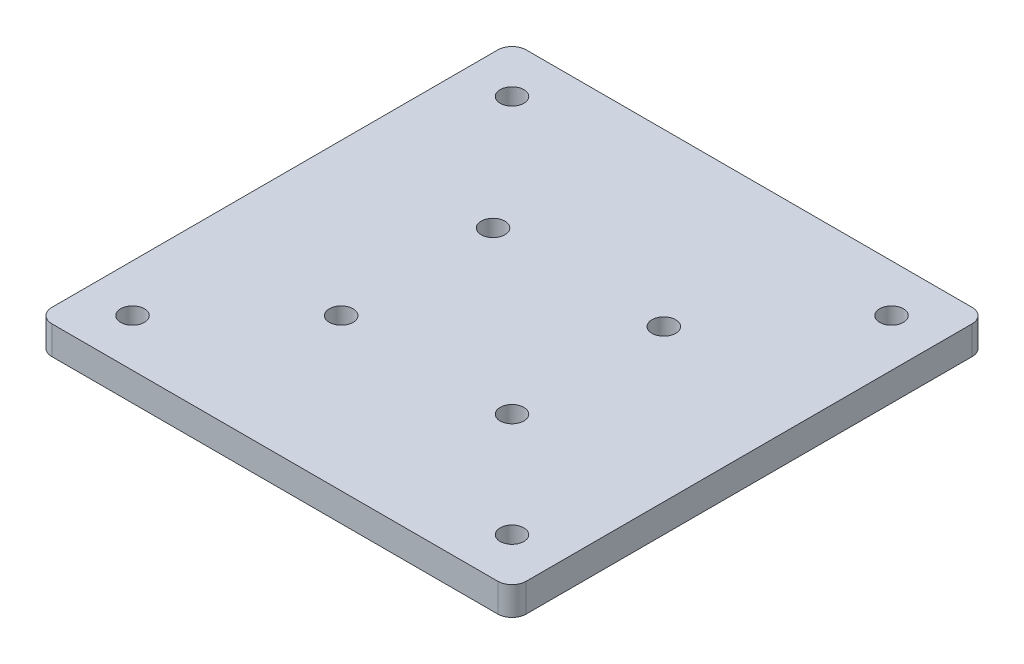
ISO-10303-21;
HEADER;
FILE_DESCRIPTION(('STEP AP214'),'2;1');
FILE_NAME('part.step','',(''),(''),'','','');
FILE_SCHEMA(('AUTOMOTIVE_DESIGN { 1 0 10303 214 1 1 1 1 }'));
ENDSEC;
DATA;
#1=APPLICATION_CONTEXT('core data for automotive mechanical design processes');
#2=APPLICATION_PROTOCOL_DEFINITION('international standard','automotive_design',2000,#1);
#3=PRODUCT_CONTEXT('',#1,'mechanical');
#4=PRODUCT('Part','Part','',(#3));
#5=PRODUCT_RELATED_PRODUCT_CATEGORY('part','',(#4));
#6=PRODUCT_DEFINITION_FORMATION('','',#4);
#7=PRODUCT_DEFINITION_CONTEXT('part definition',#1,'design');
#8=PRODUCT_DEFINITION('design','',#6,#7);
#9=PRODUCT_DEFINITION_SHAPE('','',#8);
#10=(LENGTH_UNIT() NAMED_UNIT(*) SI_UNIT(.MILLI.,.METRE.));
#11=(NAMED_UNIT(*) PLANE_ANGLE_UNIT() SI_UNIT($,.RADIAN.));
#12=(NAMED_UNIT(*) SI_UNIT($,.STERADIAN.) SOLID_ANGLE_UNIT());
#13=UNCERTAINTY_MEASURE_WITH_UNIT(LENGTH_MEASURE(1.E-05),#10,'distance_accuracy_value','');
#14=(GEOMETRIC_REPRESENTATION_CONTEXT(3) GLOBAL_UNCERTAINTY_ASSIGNED_CONTEXT((#13)) GLOBAL_UNIT_ASSIGNED_CONTEXT((#10,
#11,#12)) REPRESENTATION_CONTEXT('',''));
#15=CARTESIAN_POINT('',(0.,0.,0.));
#16=DIRECTION('',(0.,0.,1.));
#17=DIRECTION('',(1.,0.,0.));
#18=AXIS2_PLACEMENT_3D('',#15,#16,#17);
#19=CARTESIAN_POINT('',(0.,6.,0.));
#20=DIRECTION('',(0.,1.,0.));
#21=DIRECTION('',(0.,0.,1.));
#22=AXIS2_PLACEMENT_3D('',#19,#20,#21);
#23=PLANE('',#22);
#24=CARTESIAN_POINT('',(22.,6.,-54.));
#25=DIRECTION('',(0.,1.,0.));
#26=DIRECTION('',(0.,0.,1.));
#27=AXIS2_PLACEMENT_3D('',#24,#25,#26);
#28=CIRCLE('',#27,2.5);
#29=CARTESIAN_POINT('',(22.,6.,-51.5));
#30=VERTEX_POINT('',#29);
#31=EDGE_CURVE('E218',#30,#30,#28,.T.);
#32=ORIENTED_EDGE('',*,*,#31,.F.);
#33=EDGE_LOOP('',(#32));
#34=FACE_BOUND('',#33,.T.);
#35=CARTESIAN_POINT('',(22.,6.,-22.));
#36=DIRECTION('',(0.,1.,0.));
#37=DIRECTION('',(0.,0.,1.));
#38=AXIS2_PLACEMENT_3D('',#35,#36,#37);
#39=CIRCLE('',#38,2.5);
#40=CARTESIAN_POINT('',(22.,6.,-19.5));
#41=VERTEX_POINT('',#40);
#42=EDGE_CURVE('E206',#41,#41,#39,.T.);
#43=ORIENTED_EDGE('',*,*,#42,.F.);
#44=EDGE_LOOP('',(#43));
#45=FACE_BOUND('',#44,.T.);
#46=CARTESIAN_POINT('',(0.,6.,-80.));
#47=DIRECTION('',(0.,1.,0.));
#48=DIRECTION('',(0.,0.,1.));
#49=AXIS2_PLACEMENT_3D('',#46,#47,#48);
#50=CIRCLE('',#49,2.5);
#51=CARTESIAN_POINT('',(0.,6.,-77.5));
#52=VERTEX_POINT('',#51);
#53=EDGE_CURVE('E194',#52,#52,#50,.T.);
#54=ORIENTED_EDGE('',*,*,#53,.F.);
#55=EDGE_LOOP('',(#54));
#56=FACE_BOUND('',#55,.T.);
#57=CARTESIAN_POINT('',(0.,6.,0.));
#58=DIRECTION('',(0.,1.,0.));
#59=DIRECTION('',(0.,0.,1.));
#60=AXIS2_PLACEMENT_3D('',#57,#58,#59);
#61=CIRCLE('',#60,2.5);
#62=CARTESIAN_POINT('',(0.,6.,2.5));
#63=VERTEX_POINT('',#62);
#64=EDGE_CURVE('E132',#63,#63,#61,.T.);
#65=ORIENTED_EDGE('',*,*,#64,.F.);
#66=EDGE_LOOP('',(#65));
#67=FACE_BOUND('',#66,.T.);
#68=DIRECTION('',(-1.,0.,0.));
#69=VECTOR('',#68,1.);
#70=CARTESIAN_POINT('',(-10.,6.,-90.));
#71=LINE('',#70,#69);
#72=CARTESIAN_POINT('',(87.,6.,-90.));
#73=VERTEX_POINT('',#72);
#74=CARTESIAN_POINT('',(-7.00000000000001,6.,-90.));
#75=VERTEX_POINT('',#74);
#76=EDGE_CURVE('E138',#73,#75,#71,.T.);
#77=ORIENTED_EDGE('',*,*,#76,.T.);
#78=CARTESIAN_POINT('',(-7.00000000000001,6.,-87.));
#79=DIRECTION('',(0.,1.,0.));
#80=DIRECTION('',(0.,0.,1.));
#81=AXIS2_PLACEMENT_3D('',#78,#79,#80);
#82=CIRCLE('',#81,3.);
#83=CARTESIAN_POINT('',(-10.,6.,-87.));
#84=VERTEX_POINT('',#83);
#85=EDGE_CURVE('E42',#75,#84,#82,.T.);
#86=ORIENTED_EDGE('',*,*,#85,.T.);
#87=DIRECTION('',(0.,0.,1.));
#88=VECTOR('',#87,1.);
#89=CARTESIAN_POINT('',(-10.,6.,-90.));
#90=LINE('',#89,#88);
#91=CARTESIAN_POINT('',(-10.,6.,7.00000000000001));
#92=VERTEX_POINT('',#91);
#93=EDGE_CURVE('E137',#84,#92,#90,.T.);
#94=ORIENTED_EDGE('',*,*,#93,.T.);
#95=CARTESIAN_POINT('',(-7.,6.,7.));
#96=DIRECTION('',(0.,1.,0.));
#97=DIRECTION('',(0.,0.,1.));
#98=AXIS2_PLACEMENT_3D('',#95,#96,#97);
#99=CIRCLE('',#98,3.);
#100=CARTESIAN_POINT('',(-7.,6.,10.));
#101=VERTEX_POINT('',#100);
#102=EDGE_CURVE('E144',#92,#101,#99,.T.);
#103=ORIENTED_EDGE('',*,*,#102,.T.);
#104=DIRECTION('',(1.,0.,0.));
#105=VECTOR('',#104,1.);
#106=CARTESIAN_POINT('',(-10.,6.,10.));
#107=LINE('',#106,#105);
#108=CARTESIAN_POINT('',(87.,6.,10.));
#109=VERTEX_POINT('',#108);
#110=EDGE_CURVE('E121',#101,#109,#107,.T.);
#111=ORIENTED_EDGE('',*,*,#110,.T.);
#112=CARTESIAN_POINT('',(87.,6.,7.00000000000001));
#113=DIRECTION('',(0.,1.,0.));
#114=DIRECTION('',(0.,0.,1.));
#115=AXIS2_PLACEMENT_3D('',#112,#113,#114);
#116=CIRCLE('',#115,3.);
#117=CARTESIAN_POINT('',(90.,6.,7.00000000000001));
#118=VERTEX_POINT('',#117);
#119=EDGE_CURVE('E142',#109,#118,#116,.T.);
#120=ORIENTED_EDGE('',*,*,#119,.T.);
#121=DIRECTION('',(0.,0.,-1.));
#122=VECTOR('',#121,1.);
#123=CARTESIAN_POINT('',(90.,6.,-90.));
#124=LINE('',#123,#122);
#125=CARTESIAN_POINT('',(90.,6.,-87.));
#126=VERTEX_POINT('',#125);
#127=EDGE_CURVE('E178',#118,#126,#124,.T.);
#128=ORIENTED_EDGE('',*,*,#127,.T.);
#129=CARTESIAN_POINT('',(87.,6.,-87.));
#130=DIRECTION('',(0.,1.,0.));
#131=DIRECTION('',(0.,0.,1.));
#132=AXIS2_PLACEMENT_3D('',#129,#130,#131);
#133=CIRCLE('',#132,3.);
#134=EDGE_CURVE('E160',#126,#73,#133,.T.);
#135=ORIENTED_EDGE('',*,*,#134,.T.);
#136=EDGE_LOOP('',(#77,#86,#94,#103,#111,#120,#128,#135));
#137=FACE_BOUND('',#136,.T.);
#138=CARTESIAN_POINT('',(80.,6.,0.));
#139=DIRECTION('',(0.,1.,0.));
#140=DIRECTION('',(0.,0.,1.));
#141=AXIS2_PLACEMENT_3D('',#138,#139,#140);
#142=CIRCLE('',#141,2.5);
#143=CARTESIAN_POINT('',(80.,6.,2.5));
#144=VERTEX_POINT('',#143);
#145=EDGE_CURVE('E188',#144,#144,#142,.T.);
#146=ORIENTED_EDGE('',*,*,#145,.F.);
#147=EDGE_LOOP('',(#146));
#148=FACE_BOUND('',#147,.T.);
#149=CARTESIAN_POINT('',(80.,6.,-80.));
#150=DIRECTION('',(0.,1.,0.));
#151=DIRECTION('',(0.,0.,1.));
#152=AXIS2_PLACEMENT_3D('',#149,#150,#151);
#153=CIRCLE('',#152,2.5);
#154=CARTESIAN_POINT('',(80.,6.,-77.5));
#155=VERTEX_POINT('',#154);
#156=EDGE_CURVE('E200',#155,#155,#153,.T.);
#157=ORIENTED_EDGE('',*,*,#156,.F.);
#158=EDGE_LOOP('',(#157));
#159=FACE_BOUND('',#158,.T.);
#160=CARTESIAN_POINT('',(58.,6.,-22.));
#161=DIRECTION('',(0.,1.,0.));
#162=DIRECTION('',(0.,0.,1.));
#163=AXIS2_PLACEMENT_3D('',#160,#161,#162);
#164=CIRCLE('',#163,2.5);
#165=CARTESIAN_POINT('',(58.,6.,-19.5));
#166=VERTEX_POINT('',#165);
#167=EDGE_CURVE('E212',#166,#166,#164,.T.);
#168=ORIENTED_EDGE('',*,*,#167,.F.);
#169=EDGE_LOOP('',(#168));
#170=FACE_BOUND('',#169,.T.);
#171=CARTESIAN_POINT('',(58.,6.,-54.));
#172=DIRECTION('',(0.,1.,0.));
#173=DIRECTION('',(0.,0.,1.));
#174=AXIS2_PLACEMENT_3D('',#171,#172,#173);
#175=CIRCLE('',#174,2.50000000000001);
#176=CARTESIAN_POINT('',(58.,6.,-51.5));
#177=VERTEX_POINT('',#176);
#178=EDGE_CURVE('E224',#177,#177,#175,.T.);
#179=ORIENTED_EDGE('',*,*,#178,.F.);
#180=EDGE_LOOP('',(#179));
#181=FACE_BOUND('',#180,.T.);
#182=ADVANCED_FACE('F34',(#34,#45,#56,#67,#137,#148,#159,#170,#181),#23,.T.);
#183=CARTESIAN_POINT('',(0.,0.,0.));
#184=DIRECTION('',(0.,1.,0.));
#185=DIRECTION('',(0.,0.,1.));
#186=AXIS2_PLACEMENT_3D('',#183,#184,#185);
#187=PLANE('',#186);
#188=CARTESIAN_POINT('',(22.,0.,-54.));
#189=DIRECTION('',(0.,1.,0.));
#190=DIRECTION('',(0.,0.,1.));
#191=AXIS2_PLACEMENT_3D('',#188,#189,#190);
#192=CIRCLE('',#191,2.5);
#193=CARTESIAN_POINT('',(22.,0.,-51.5));
#194=VERTEX_POINT('',#193);
#195=EDGE_CURVE('E221',#194,#194,#192,.T.);
#196=ORIENTED_EDGE('',*,*,#195,.T.);
#197=EDGE_LOOP('',(#196));
#198=FACE_BOUND('',#197,.T.);
#199=CARTESIAN_POINT('',(22.,0.,-22.));
#200=DIRECTION('',(0.,1.,0.));
#201=DIRECTION('',(0.,0.,1.));
#202=AXIS2_PLACEMENT_3D('',#199,#200,#201);
#203=CIRCLE('',#202,2.5);
#204=CARTESIAN_POINT('',(22.,0.,-19.5));
#205=VERTEX_POINT('',#204);
#206=EDGE_CURVE('E209',#205,#205,#203,.T.);
#207=ORIENTED_EDGE('',*,*,#206,.T.);
#208=EDGE_LOOP('',(#207));
#209=FACE_BOUND('',#208,.T.);
#210=CARTESIAN_POINT('',(0.,0.,-80.));
#211=DIRECTION('',(0.,1.,0.));
#212=DIRECTION('',(0.,0.,1.));
#213=AXIS2_PLACEMENT_3D('',#210,#211,#212);
#214=CIRCLE('',#213,2.5);
#215=CARTESIAN_POINT('',(0.,0.,-77.5));
#216=VERTEX_POINT('',#215);
#217=EDGE_CURVE('E197',#216,#216,#214,.T.);
#218=ORIENTED_EDGE('',*,*,#217,.T.);
#219=EDGE_LOOP('',(#218));
#220=FACE_BOUND('',#219,.T.);
#221=CARTESIAN_POINT('',(0.,0.,0.));
#222=DIRECTION('',(0.,1.,0.));
#223=DIRECTION('',(0.,0.,1.));
#224=AXIS2_PLACEMENT_3D('',#221,#222,#223);
#225=CIRCLE('',#224,2.5);
#226=CARTESIAN_POINT('',(0.,0.,2.5));
#227=VERTEX_POINT('',#226);
#228=EDGE_CURVE('E185',#227,#227,#225,.T.);
#229=ORIENTED_EDGE('',*,*,#228,.T.);
#230=EDGE_LOOP('',(#229));
#231=FACE_BOUND('',#230,.T.);
#232=DIRECTION('',(0.,0.,1.));
#233=VECTOR('',#232,1.);
#234=CARTESIAN_POINT('',(-10.,0.,-90.));
#235=LINE('',#234,#233);
#236=CARTESIAN_POINT('',(-10.,0.,-87.));
#237=VERTEX_POINT('',#236);
#238=CARTESIAN_POINT('',(-10.,0.,7.00000000000001));
#239=VERTEX_POINT('',#238);
#240=EDGE_CURVE('E128',#237,#239,#235,.T.);
#241=ORIENTED_EDGE('',*,*,#240,.F.);
#242=CARTESIAN_POINT('',(-7.00000000000001,0.,-87.));
#243=DIRECTION('',(0.,1.,0.));
#244=DIRECTION('',(0.,0.,1.));
#245=AXIS2_PLACEMENT_3D('',#242,#243,#244);
#246=CIRCLE('',#245,3.);
#247=CARTESIAN_POINT('',(-7.00000000000001,0.,-90.));
#248=VERTEX_POINT('',#247);
#249=EDGE_CURVE('E154',#237,#248,#246,.F.);
#250=ORIENTED_EDGE('',*,*,#249,.T.);
#251=DIRECTION('',(-1.,0.,0.));
#252=VECTOR('',#251,1.);
#253=CARTESIAN_POINT('',(-10.,0.,-90.));
#254=LINE('',#253,#252);
#255=CARTESIAN_POINT('',(87.,0.,-90.));
#256=VERTEX_POINT('',#255);
#257=EDGE_CURVE('E130',#256,#248,#254,.T.);
#258=ORIENTED_EDGE('',*,*,#257,.F.);
#259=CARTESIAN_POINT('',(87.,0.,-87.));
#260=DIRECTION('',(0.,1.,0.));
#261=DIRECTION('',(0.,0.,1.));
#262=AXIS2_PLACEMENT_3D('',#259,#260,#261);
#263=CIRCLE('',#262,3.);
#264=CARTESIAN_POINT('',(90.,0.,-87.));
#265=VERTEX_POINT('',#264);
#266=EDGE_CURVE('E152',#256,#265,#263,.F.);
#267=ORIENTED_EDGE('',*,*,#266,.T.);
#268=DIRECTION('',(0.,0.,-1.));
#269=VECTOR('',#268,1.);
#270=CARTESIAN_POINT('',(90.,0.,-90.));
#271=LINE('',#270,#269);
#272=CARTESIAN_POINT('',(90.,0.,7.00000000000001));
#273=VERTEX_POINT('',#272);
#274=EDGE_CURVE('E127',#273,#265,#271,.T.);
#275=ORIENTED_EDGE('',*,*,#274,.F.);
#276=CARTESIAN_POINT('',(87.,0.,7.00000000000001));
#277=DIRECTION('',(0.,1.,0.));
#278=DIRECTION('',(0.,0.,1.));
#279=AXIS2_PLACEMENT_3D('',#276,#277,#278);
#280=CIRCLE('',#279,3.);
#281=CARTESIAN_POINT('',(87.,0.,10.));
#282=VERTEX_POINT('',#281);
#283=EDGE_CURVE('E112',#273,#282,#280,.F.);
#284=ORIENTED_EDGE('',*,*,#283,.T.);
#285=DIRECTION('',(1.,0.,0.));
#286=VECTOR('',#285,1.);
#287=CARTESIAN_POINT('',(-10.,0.,10.));
#288=LINE('',#287,#286);
#289=CARTESIAN_POINT('',(-7.,0.,10.));
#290=VERTEX_POINT('',#289);
#291=EDGE_CURVE('E118',#290,#282,#288,.T.);
#292=ORIENTED_EDGE('',*,*,#291,.F.);
#293=CARTESIAN_POINT('',(-7.,0.,7.));
#294=DIRECTION('',(0.,1.,0.));
#295=DIRECTION('',(0.,0.,1.));
#296=AXIS2_PLACEMENT_3D('',#293,#294,#295);
#297=CIRCLE('',#296,3.);
#298=EDGE_CURVE('E102',#290,#239,#297,.F.);
#299=ORIENTED_EDGE('',*,*,#298,.T.);
#300=EDGE_LOOP('',(#241,#250,#258,#267,#275,#284,#292,#299));
#301=FACE_BOUND('',#300,.T.);
#302=CARTESIAN_POINT('',(80.,0.,0.));
#303=DIRECTION('',(0.,1.,0.));
#304=DIRECTION('',(0.,0.,1.));
#305=AXIS2_PLACEMENT_3D('',#302,#303,#304);
#306=CIRCLE('',#305,2.5);
#307=CARTESIAN_POINT('',(80.,0.,2.5));
#308=VERTEX_POINT('',#307);
#309=EDGE_CURVE('E191',#308,#308,#306,.T.);
#310=ORIENTED_EDGE('',*,*,#309,.T.);
#311=EDGE_LOOP('',(#310));
#312=FACE_BOUND('',#311,.T.);
#313=CARTESIAN_POINT('',(80.,0.,-80.));
#314=DIRECTION('',(0.,1.,0.));
#315=DIRECTION('',(0.,0.,1.));
#316=AXIS2_PLACEMENT_3D('',#313,#314,#315);
#317=CIRCLE('',#316,2.5);
#318=CARTESIAN_POINT('',(80.,0.,-77.5));
#319=VERTEX_POINT('',#318);
#320=EDGE_CURVE('E203',#319,#319,#317,.T.);
#321=ORIENTED_EDGE('',*,*,#320,.T.);
#322=EDGE_LOOP('',(#321));
#323=FACE_BOUND('',#322,.T.);
#324=CARTESIAN_POINT('',(58.,0.,-22.));
#325=DIRECTION('',(0.,1.,0.));
#326=DIRECTION('',(0.,0.,1.));
#327=AXIS2_PLACEMENT_3D('',#324,#325,#326);
#328=CIRCLE('',#327,2.5);
#329=CARTESIAN_POINT('',(58.,0.,-19.5));
#330=VERTEX_POINT('',#329);
#331=EDGE_CURVE('E215',#330,#330,#328,.T.);
#332=ORIENTED_EDGE('',*,*,#331,.T.);
#333=EDGE_LOOP('',(#332));
#334=FACE_BOUND('',#333,.T.);
#335=CARTESIAN_POINT('',(58.,0.,-54.));
#336=DIRECTION('',(0.,1.,0.));
#337=DIRECTION('',(0.,0.,1.));
#338=AXIS2_PLACEMENT_3D('',#335,#336,#337);
#339=CIRCLE('',#338,2.50000000000001);
#340=CARTESIAN_POINT('',(58.,0.,-51.5));
#341=VERTEX_POINT('',#340);
#342=EDGE_CURVE('E227',#341,#341,#339,.T.);
#343=ORIENTED_EDGE('',*,*,#342,.T.);
#344=EDGE_LOOP('',(#343));
#345=FACE_BOUND('',#344,.T.);
#346=ADVANCED_FACE('F124',(#198,#209,#220,#231,#301,#312,#323,#334,#345),#187,.F.);
#347=CARTESIAN_POINT('',(-10.,6.,-90.));
#348=DIRECTION('',(1.,0.,0.));
#349=DIRECTION('',(0.,0.,-1.));
#350=AXIS2_PLACEMENT_3D('',#347,#348,#349);
#351=PLANE('',#350);
#352=ORIENTED_EDGE('',*,*,#93,.F.);
#353=DIRECTION('',(0.,-1.,0.));
#354=VECTOR('',#353,1.);
#355=CARTESIAN_POINT('',(-10.,6.,-87.));
#356=LINE('',#355,#354);
#357=EDGE_CURVE('E149',#84,#237,#356,.T.);
#358=ORIENTED_EDGE('',*,*,#357,.T.);
#359=ORIENTED_EDGE('',*,*,#240,.T.);
#360=DIRECTION('',(0.,-1.,0.));
#361=VECTOR('',#360,1.);
#362=CARTESIAN_POINT('',(-10.,6.,7.00000000000001));
#363=LINE('',#362,#361);
#364=EDGE_CURVE('E108',#239,#92,#363,.F.);
#365=ORIENTED_EDGE('',*,*,#364,.T.);
#366=EDGE_LOOP('',(#352,#358,#359,#365));
#367=FACE_BOUND('',#366,.T.);
#368=ADVANCED_FACE('F168',(#367),#351,.F.);
#369=CARTESIAN_POINT('',(-10.,6.,10.));
#370=DIRECTION('',(0.,0.,-1.));
#371=DIRECTION('',(-1.,0.,0.));
#372=AXIS2_PLACEMENT_3D('',#369,#370,#371);
#373=PLANE('',#372);
#374=ORIENTED_EDGE('',*,*,#110,.F.);
#375=DIRECTION('',(0.,-1.,0.));
#376=VECTOR('',#375,1.);
#377=CARTESIAN_POINT('',(-7.,6.,10.));
#378=LINE('',#377,#376);
#379=EDGE_CURVE('E106',#101,#290,#378,.T.);
#380=ORIENTED_EDGE('',*,*,#379,.T.);
#381=ORIENTED_EDGE('',*,*,#291,.T.);
#382=DIRECTION('',(0.,-1.,0.));
#383=VECTOR('',#382,1.);
#384=CARTESIAN_POINT('',(87.,6.,10.));
#385=LINE('',#384,#383);
#386=EDGE_CURVE('E122',#282,#109,#385,.F.);
#387=ORIENTED_EDGE('',*,*,#386,.T.);
#388=EDGE_LOOP('',(#374,#380,#381,#387));
#389=FACE_BOUND('',#388,.T.);
#390=ADVANCED_FACE('F117',(#389),#373,.F.);
#391=CARTESIAN_POINT('',(90.,6.,-90.));
#392=DIRECTION('',(-1.,0.,0.));
#393=DIRECTION('',(0.,0.,1.));
#394=AXIS2_PLACEMENT_3D('',#391,#392,#393);
#395=PLANE('',#394);
#396=ORIENTED_EDGE('',*,*,#274,.T.);
#397=DIRECTION('',(0.,-1.,0.));
#398=VECTOR('',#397,1.);
#399=CARTESIAN_POINT('',(90.,6.,-87.));
#400=LINE('',#399,#398);
#401=EDGE_CURVE('E11',#265,#126,#400,.F.);
#402=ORIENTED_EDGE('',*,*,#401,.T.);
#403=ORIENTED_EDGE('',*,*,#127,.F.);
#404=DIRECTION('',(0.,-1.,0.));
#405=VECTOR('',#404,1.);
#406=CARTESIAN_POINT('',(90.,6.,7.00000000000001));
#407=LINE('',#406,#405);
#408=EDGE_CURVE('E146',#118,#273,#407,.T.);
#409=ORIENTED_EDGE('',*,*,#408,.T.);
#410=EDGE_LOOP('',(#396,#402,#403,#409));
#411=FACE_BOUND('',#410,.T.);
#412=ADVANCED_FACE('F176',(#411),#395,.F.);
#413=CARTESIAN_POINT('',(-10.,6.,-90.));
#414=DIRECTION('',(0.,0.,1.));
#415=DIRECTION('',(1.,0.,0.));
#416=AXIS2_PLACEMENT_3D('',#413,#414,#415);
#417=PLANE('',#416);
#418=ORIENTED_EDGE('',*,*,#257,.T.);
#419=DIRECTION('',(0.,-1.,0.));
#420=VECTOR('',#419,1.);
#421=CARTESIAN_POINT('',(-7.00000000000001,6.,-90.));
#422=LINE('',#421,#420);
#423=EDGE_CURVE('E55',#248,#75,#422,.F.);
#424=ORIENTED_EDGE('',*,*,#423,.T.);
#425=ORIENTED_EDGE('',*,*,#76,.F.);
#426=DIRECTION('',(0.,-1.,0.));
#427=VECTOR('',#426,1.);
#428=CARTESIAN_POINT('',(87.,6.,-90.));
#429=LINE('',#428,#427);
#430=EDGE_CURVE('E156',#73,#256,#429,.T.);
#431=ORIENTED_EDGE('',*,*,#430,.T.);
#432=EDGE_LOOP('',(#418,#424,#425,#431));
#433=FACE_BOUND('',#432,.T.);
#434=ADVANCED_FACE('F172',(#433),#417,.F.);
#435=CARTESIAN_POINT('',(0.,6.,0.));
#436=DIRECTION('',(0.,-1.,0.));
#437=DIRECTION('',(0.,0.,-1.));
#438=AXIS2_PLACEMENT_3D('',#435,#436,#437);
#439=CYLINDRICAL_SURFACE('',#438,2.5);
#440=ORIENTED_EDGE('',*,*,#64,.T.);
#441=EDGE_LOOP('',(#440));
#442=FACE_BOUND('',#441,.T.);
#443=ORIENTED_EDGE('',*,*,#228,.F.);
#444=EDGE_LOOP('',(#443));
#445=FACE_BOUND('',#444,.T.);
#446=ADVANCED_FACE('F247',(#442,#445),#439,.F.);
#447=CARTESIAN_POINT('',(80.,6.,0.));
#448=DIRECTION('',(0.,-1.,0.));
#449=DIRECTION('',(0.,0.,-1.));
#450=AXIS2_PLACEMENT_3D('',#447,#448,#449);
#451=CYLINDRICAL_SURFACE('',#450,2.5);
#452=ORIENTED_EDGE('',*,*,#145,.T.);
#453=EDGE_LOOP('',(#452));
#454=FACE_BOUND('',#453,.T.);
#455=ORIENTED_EDGE('',*,*,#309,.F.);
#456=EDGE_LOOP('',(#455));
#457=FACE_BOUND('',#456,.T.);
#458=ADVANCED_FACE('F377',(#454,#457),#451,.F.);
#459=CARTESIAN_POINT('',(0.,6.,-80.));
#460=DIRECTION('',(0.,-1.,0.));
#461=DIRECTION('',(0.,0.,-1.));
#462=AXIS2_PLACEMENT_3D('',#459,#460,#461);
#463=CYLINDRICAL_SURFACE('',#462,2.5);
#464=ORIENTED_EDGE('',*,*,#53,.T.);
#465=EDGE_LOOP('',(#464));
#466=FACE_BOUND('',#465,.T.);
#467=ORIENTED_EDGE('',*,*,#217,.F.);
#468=EDGE_LOOP('',(#467));
#469=FACE_BOUND('',#468,.T.);
#470=ADVANCED_FACE('F367',(#466,#469),#463,.F.);
#471=CARTESIAN_POINT('',(80.,6.,-80.));
#472=DIRECTION('',(0.,-1.,0.));
#473=DIRECTION('',(0.,0.,-1.));
#474=AXIS2_PLACEMENT_3D('',#471,#472,#473);
#475=CYLINDRICAL_SURFACE('',#474,2.5);
#476=ORIENTED_EDGE('',*,*,#156,.T.);
#477=EDGE_LOOP('',(#476));
#478=FACE_BOUND('',#477,.T.);
#479=ORIENTED_EDGE('',*,*,#320,.F.);
#480=EDGE_LOOP('',(#479));
#481=FACE_BOUND('',#480,.T.);
#482=ADVANCED_FACE('F357',(#478,#481),#475,.F.);
#483=CARTESIAN_POINT('',(22.,6.,-22.));
#484=DIRECTION('',(0.,-1.,0.));
#485=DIRECTION('',(0.,0.,-1.));
#486=AXIS2_PLACEMENT_3D('',#483,#484,#485);
#487=CYLINDRICAL_SURFACE('',#486,2.5);
#488=ORIENTED_EDGE('',*,*,#42,.T.);
#489=EDGE_LOOP('',(#488));
#490=FACE_BOUND('',#489,.T.);
#491=ORIENTED_EDGE('',*,*,#206,.F.);
#492=EDGE_LOOP('',(#491));
#493=FACE_BOUND('',#492,.T.);
#494=ADVANCED_FACE('F347',(#490,#493),#487,.F.);
#495=CARTESIAN_POINT('',(58.,6.,-22.));
#496=DIRECTION('',(0.,-1.,0.));
#497=DIRECTION('',(0.,0.,-1.));
#498=AXIS2_PLACEMENT_3D('',#495,#496,#497);
#499=CYLINDRICAL_SURFACE('',#498,2.5);
#500=ORIENTED_EDGE('',*,*,#167,.T.);
#501=EDGE_LOOP('',(#500));
#502=FACE_BOUND('',#501,.T.);
#503=ORIENTED_EDGE('',*,*,#331,.F.);
#504=EDGE_LOOP('',(#503));
#505=FACE_BOUND('',#504,.T.);
#506=ADVANCED_FACE('F337',(#502,#505),#499,.F.);
#507=CARTESIAN_POINT('',(22.,6.,-54.));
#508=DIRECTION('',(0.,-1.,0.));
#509=DIRECTION('',(0.,0.,-1.));
#510=AXIS2_PLACEMENT_3D('',#507,#508,#509);
#511=CYLINDRICAL_SURFACE('',#510,2.5);
#512=ORIENTED_EDGE('',*,*,#31,.T.);
#513=EDGE_LOOP('',(#512));
#514=FACE_BOUND('',#513,.T.);
#515=ORIENTED_EDGE('',*,*,#195,.F.);
#516=EDGE_LOOP('',(#515));
#517=FACE_BOUND('',#516,.T.);
#518=ADVANCED_FACE('F328',(#514,#517),#511,.F.);
#519=CARTESIAN_POINT('',(58.,6.,-54.));
#520=DIRECTION('',(0.,-1.,0.));
#521=DIRECTION('',(0.,0.,-1.));
#522=AXIS2_PLACEMENT_3D('',#519,#520,#521);
#523=CYLINDRICAL_SURFACE('',#522,2.50000000000001);
#524=ORIENTED_EDGE('',*,*,#178,.T.);
#525=EDGE_LOOP('',(#524));
#526=FACE_BOUND('',#525,.T.);
#527=ORIENTED_EDGE('',*,*,#342,.F.);
#528=EDGE_LOOP('',(#527));
#529=FACE_BOUND('',#528,.T.);
#530=ADVANCED_FACE('F233',(#526,#529),#523,.F.);
#531=CARTESIAN_POINT('',(-7.,6.,7.));
#532=DIRECTION('',(0.,-1.,0.));
#533=DIRECTION('',(0.,0.,-1.));
#534=AXIS2_PLACEMENT_3D('',#531,#532,#533);
#535=CYLINDRICAL_SURFACE('',#534,3.);
#536=ORIENTED_EDGE('',*,*,#102,.F.);
#537=ORIENTED_EDGE('',*,*,#364,.F.);
#538=ORIENTED_EDGE('',*,*,#298,.F.);
#539=ORIENTED_EDGE('',*,*,#379,.F.);
#540=EDGE_LOOP('',(#536,#537,#538,#539));
#541=FACE_BOUND('',#540,.T.);
#542=ADVANCED_FACE('F105',(#541),#535,.T.);
#543=CARTESIAN_POINT('',(87.,6.,7.00000000000001));
#544=DIRECTION('',(0.,-1.,0.));
#545=DIRECTION('',(0.,0.,-1.));
#546=AXIS2_PLACEMENT_3D('',#543,#544,#545);
#547=CYLINDRICAL_SURFACE('',#546,3.);
#548=ORIENTED_EDGE('',*,*,#119,.F.);
#549=ORIENTED_EDGE('',*,*,#386,.F.);
#550=ORIENTED_EDGE('',*,*,#283,.F.);
#551=ORIENTED_EDGE('',*,*,#408,.F.);
#552=EDGE_LOOP('',(#548,#549,#550,#551));
#553=FACE_BOUND('',#552,.T.);
#554=ADVANCED_FACE('F181',(#553),#547,.T.);
#555=CARTESIAN_POINT('',(-7.00000000000001,6.,-87.));
#556=DIRECTION('',(0.,-1.,0.));
#557=DIRECTION('',(0.,0.,-1.));
#558=AXIS2_PLACEMENT_3D('',#555,#556,#557);
#559=CYLINDRICAL_SURFACE('',#558,3.);
#560=ORIENTED_EDGE('',*,*,#85,.F.);
#561=ORIENTED_EDGE('',*,*,#423,.F.);
#562=ORIENTED_EDGE('',*,*,#249,.F.);
#563=ORIENTED_EDGE('',*,*,#357,.F.);
#564=EDGE_LOOP('',(#560,#561,#562,#563));
#565=FACE_BOUND('',#564,.T.);
#566=ADVANCED_FACE('F170',(#565),#559,.T.);
#567=CARTESIAN_POINT('',(87.,6.,-87.));
#568=DIRECTION('',(0.,-1.,0.));
#569=DIRECTION('',(0.,0.,-1.));
#570=AXIS2_PLACEMENT_3D('',#567,#568,#569);
#571=CYLINDRICAL_SURFACE('',#570,3.);
#572=ORIENTED_EDGE('',*,*,#134,.F.);
#573=ORIENTED_EDGE('',*,*,#401,.F.);
#574=ORIENTED_EDGE('',*,*,#266,.F.);
#575=ORIENTED_EDGE('',*,*,#430,.F.);
#576=EDGE_LOOP('',(#572,#573,#574,#575));
#577=FACE_BOUND('',#576,.T.);
#578=ADVANCED_FACE('F36',(#577),#571,.T.);
#579=CLOSED_SHELL('',(#182,#346,#368,#390,#412,#434,#446,#458,#470,#482,#494,#506,#518,#530,
#542,#554,#566,#578));
#580=MANIFOLD_SOLID_BREP('B2',#579);
#581=ADVANCED_BREP_SHAPE_REPRESENTATION('',(#18,#580),#14);
#582=SHAPE_DEFINITION_REPRESENTATION(#9,#581);
ENDSEC;
END-ISO-10303-21;
